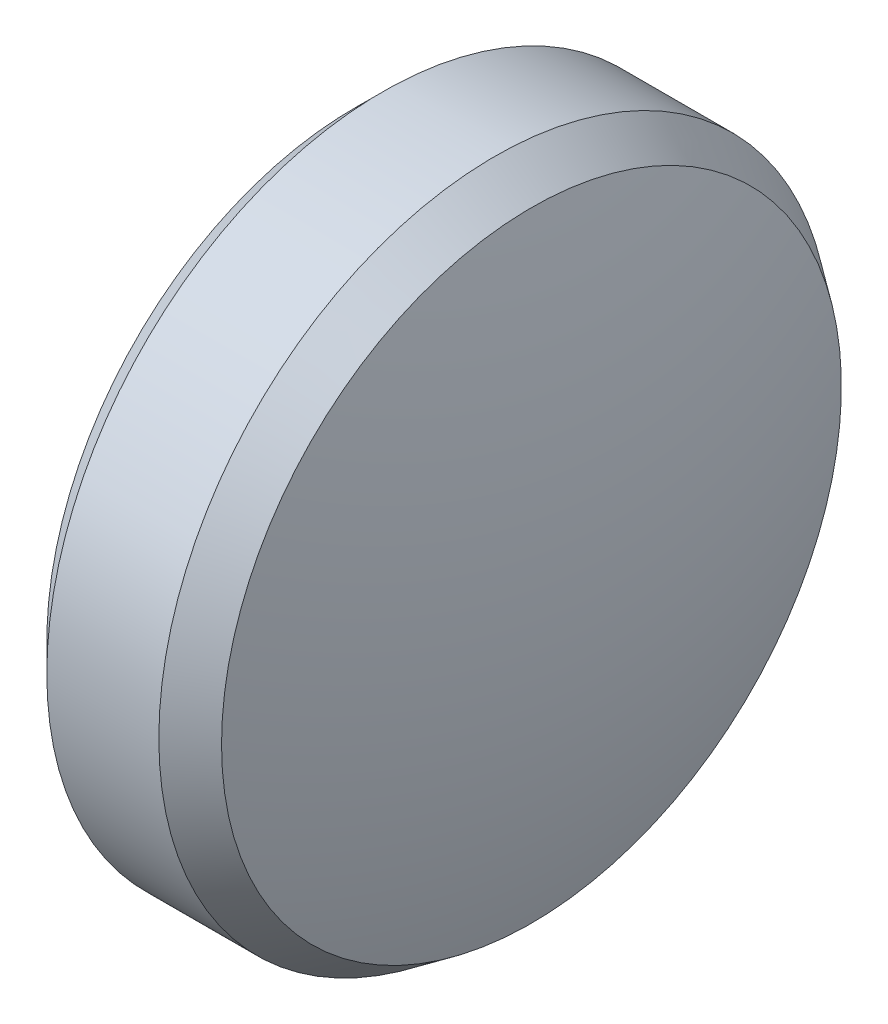
ISO-10303-21;
HEADER;
FILE_DESCRIPTION(('STEP AP214'),'2;1');
FILE_NAME('part.step','',(''),(''),'','','');
FILE_SCHEMA(('AUTOMOTIVE_DESIGN { 1 0 10303 214 1 1 1 1 }'));
ENDSEC;
DATA;
#1=APPLICATION_CONTEXT('core data for automotive mechanical design processes');
#2=APPLICATION_PROTOCOL_DEFINITION('international standard','automotive_design',2000,#1);
#3=PRODUCT_CONTEXT('',#1,'mechanical');
#4=PRODUCT('Part','Part','',(#3));
#5=PRODUCT_RELATED_PRODUCT_CATEGORY('part','',(#4));
#6=PRODUCT_DEFINITION_FORMATION('','',#4);
#7=PRODUCT_DEFINITION_CONTEXT('part definition',#1,'design');
#8=PRODUCT_DEFINITION('design','',#6,#7);
#9=PRODUCT_DEFINITION_SHAPE('','',#8);
#10=(LENGTH_UNIT() NAMED_UNIT(*) SI_UNIT(.MILLI.,.METRE.));
#11=(NAMED_UNIT(*) PLANE_ANGLE_UNIT() SI_UNIT($,.RADIAN.));
#12=(NAMED_UNIT(*) SI_UNIT($,.STERADIAN.) SOLID_ANGLE_UNIT());
#13=UNCERTAINTY_MEASURE_WITH_UNIT(LENGTH_MEASURE(1.E-05),#10,'distance_accuracy_value','');
#14=(GEOMETRIC_REPRESENTATION_CONTEXT(3) GLOBAL_UNCERTAINTY_ASSIGNED_CONTEXT((#13)) GLOBAL_UNIT_ASSIGNED_CONTEXT((#10,
#11,#12)) REPRESENTATION_CONTEXT('',''));
#15=CARTESIAN_POINT('',(0.,0.,0.));
#16=DIRECTION('',(0.,0.,1.));
#17=DIRECTION('',(1.,0.,0.));
#18=AXIS2_PLACEMENT_3D('',#15,#16,#17);
#19=CARTESIAN_POINT('',(-1.,0.,0.));
#20=DIRECTION('',(1.,0.,0.));
#21=DIRECTION('',(0.,0.,-1.));
#22=AXIS2_PLACEMENT_3D('',#19,#20,#21);
#23=PLANE('',#22);
#24=CARTESIAN_POINT('',(-1.,0.,0.));
#25=DIRECTION('',(1.,0.,0.));
#26=DIRECTION('',(0.,0.,-1.));
#27=AXIS2_PLACEMENT_3D('',#24,#25,#26);
#28=CIRCLE('',#27,2.75);
#29=CARTESIAN_POINT('',(-1.,0.,-2.75));
#30=VERTEX_POINT('',#29);
#31=EDGE_CURVE('E10',#30,#30,#28,.F.);
#32=ORIENTED_EDGE('',*,*,#31,.T.);
#33=EDGE_LOOP('',(#32));
#34=FACE_BOUND('',#33,.T.);
#35=ADVANCED_FACE('F15',(#34),#23,.F.);
#36=CARTESIAN_POINT('',(-1.,0.,0.));
#37=DIRECTION('',(-1.,0.,0.));
#38=DIRECTION('',(0.,0.,1.));
#39=AXIS2_PLACEMENT_3D('',#36,#37,#38);
#40=CYLINDRICAL_SURFACE('',#39,3.);
#41=CARTESIAN_POINT('',(0.249999999999999,0.,0.));
#42=DIRECTION('',(-1.,0.,0.));
#43=DIRECTION('',(0.,0.,1.));
#44=AXIS2_PLACEMENT_3D('',#41,#42,#43);
#45=CIRCLE('',#44,3.);
#46=CARTESIAN_POINT('',(0.249999999999999,0.,3.));
#47=VERTEX_POINT('',#46);
#48=EDGE_CURVE('E55',#47,#47,#45,.T.);
#49=ORIENTED_EDGE('',*,*,#48,.T.);
#50=EDGE_LOOP('',(#49));
#51=FACE_BOUND('',#50,.T.);
#52=CARTESIAN_POINT('',(-0.75,0.,0.));
#53=DIRECTION('',(1.,0.,0.));
#54=DIRECTION('',(0.,0.,-1.));
#55=AXIS2_PLACEMENT_3D('',#52,#53,#54);
#56=CIRCLE('',#55,3.);
#57=CARTESIAN_POINT('',(-0.75,0.,-3.));
#58=VERTEX_POINT('',#57);
#59=EDGE_CURVE('E53',#58,#58,#56,.T.);
#60=ORIENTED_EDGE('',*,*,#59,.T.);
#61=EDGE_LOOP('',(#60));
#62=FACE_BOUND('',#61,.T.);
#63=ADVANCED_FACE('F28',(#51,#62),#40,.T.);
#64=CARTESIAN_POINT('',(-8.19999622527476,0.,0.00833396245420674));
#65=DIRECTION('',(0.,-1.,0.));
#66=DIRECTION('',(0.,0.,1.));
#67=AXIS2_PLACEMENT_3D('',#64,#65,#66);
#68=CIRCLE('',#67,9.2);
#69=TRIMMED_CURVE('',#68,(PARAMETER_VALUE(-1.57170219240294)),
(PARAMETER_VALUE(1.57170219240294)),.T.,.PARAMETER.);
#70=CARTESIAN_POINT('',(-8.19999622527476,0.,0.));
#71=DIRECTION('',(-1.,0.,0.));
#72=AXIS1_PLACEMENT('',#70,#71);
#73=SURFACE_OF_REVOLUTION('',#69,#72);
#74=CARTESIAN_POINT('',(0.576707561666579,0.,0.));
#75=DIRECTION('',(-1.,0.,0.));
#76=DIRECTION('',(0.,0.,1.));
#77=AXIS2_PLACEMENT_3D('',#74,#75,#76);
#78=CIRCLE('',#77,2.76686085851478);
#79=CARTESIAN_POINT('',(0.576707561666579,0.,2.76686085851478));
#80=VERTEX_POINT('',#79);
#81=EDGE_CURVE('E22',#80,#80,#78,.F.);
#82=ORIENTED_EDGE('',*,*,#81,.T.);
#83=EDGE_LOOP('',(#82));
#84=FACE_BOUND('',#83,.T.);
#85=CARTESIAN_POINT('',(1.,0.,0.));
#86=VERTEX_POINT('',#85);
#87=VERTEX_LOOP('',#86);
#88=FACE_BOUND('',#87,.T.);
#89=ADVANCED_FACE('F25',(#84,#88),#73,.T.);
#90=CARTESIAN_POINT('',(0.249999999999999,0.,0.));
#91=DIRECTION('',(-1.,0.,0.));
#92=DIRECTION('',(0.,0.,1.));
#93=AXIS2_PLACEMENT_3D('',#90,#91,#92);
#94=CONICAL_SURFACE('',#93,3.,0.619796553178797);
#95=ORIENTED_EDGE('',*,*,#81,.F.);
#96=EDGE_LOOP('',(#95));
#97=FACE_BOUND('',#96,.T.);
#98=ORIENTED_EDGE('',*,*,#48,.F.);
#99=EDGE_LOOP('',(#98));
#100=FACE_BOUND('',#99,.T.);
#101=ADVANCED_FACE('F27',(#97,#100),#94,.T.);
#102=CARTESIAN_POINT('',(-1.,0.,0.));
#103=DIRECTION('',(1.,0.,0.));
#104=DIRECTION('',(0.,0.,-1.));
#105=AXIS2_PLACEMENT_3D('',#102,#103,#104);
#106=CONICAL_SURFACE('',#105,2.75,0.785398163397447);
#107=ORIENTED_EDGE('',*,*,#59,.F.);
#108=EDGE_LOOP('',(#107));
#109=FACE_BOUND('',#108,.T.);
#110=ORIENTED_EDGE('',*,*,#31,.F.);
#111=EDGE_LOOP('',(#110));
#112=FACE_BOUND('',#111,.T.);
#113=ADVANCED_FACE('F17',(#109,#112),#106,.T.);
#114=CLOSED_SHELL('',(#35,#63,#89,#101,#113));
#115=MANIFOLD_SOLID_BREP('B1',#114);
#116=ADVANCED_BREP_SHAPE_REPRESENTATION('',(#18,#115),#14);
#117=SHAPE_DEFINITION_REPRESENTATION(#9,#116);
ENDSEC;
END-ISO-10303-21;
